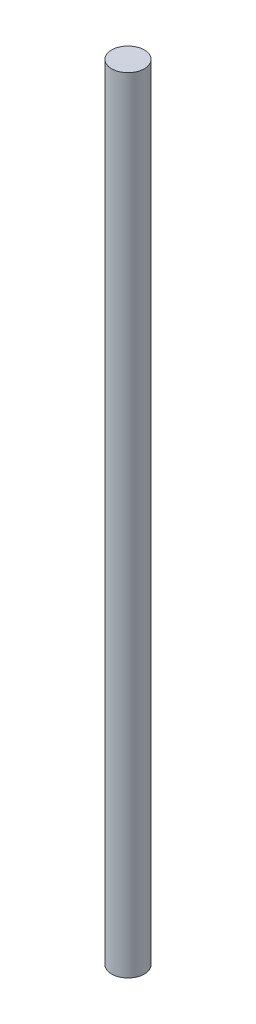
ISO-10303-21;
HEADER;
FILE_DESCRIPTION(('STEP AP214'),'2;1');
FILE_NAME('part.step','',(''),(''),'','','');
FILE_SCHEMA(('AUTOMOTIVE_DESIGN { 1 0 10303 214 1 1 1 1 }'));
ENDSEC;
DATA;
#1=APPLICATION_CONTEXT('core data for automotive mechanical design processes');
#2=APPLICATION_PROTOCOL_DEFINITION('international standard','automotive_design',2000,#1);
#3=PRODUCT_CONTEXT('',#1,'mechanical');
#4=PRODUCT('Part','Part','',(#3));
#5=PRODUCT_RELATED_PRODUCT_CATEGORY('part','',(#4));
#6=PRODUCT_DEFINITION_FORMATION('','',#4);
#7=PRODUCT_DEFINITION_CONTEXT('part definition',#1,'design');
#8=PRODUCT_DEFINITION('design','',#6,#7);
#9=PRODUCT_DEFINITION_SHAPE('','',#8);
#10=(LENGTH_UNIT() NAMED_UNIT(*) SI_UNIT(.MILLI.,.METRE.));
#11=(NAMED_UNIT(*) PLANE_ANGLE_UNIT() SI_UNIT($,.RADIAN.));
#12=(NAMED_UNIT(*) SI_UNIT($,.STERADIAN.) SOLID_ANGLE_UNIT());
#13=UNCERTAINTY_MEASURE_WITH_UNIT(LENGTH_MEASURE(1.E-05),#10,'distance_accuracy_value','');
#14=(GEOMETRIC_REPRESENTATION_CONTEXT(3) GLOBAL_UNCERTAINTY_ASSIGNED_CONTEXT((#13)) GLOBAL_UNIT_ASSIGNED_CONTEXT((#10,
#11,#12)) REPRESENTATION_CONTEXT('',''));
#15=CARTESIAN_POINT('',(0.,0.,0.));
#16=DIRECTION('',(0.,0.,1.));
#17=DIRECTION('',(1.,0.,0.));
#18=AXIS2_PLACEMENT_3D('',#15,#16,#17);
#19=CARTESIAN_POINT('',(0.,76.2,0.));
#20=DIRECTION('',(0.,-1.,0.));
#21=DIRECTION('',(0.,0.,-1.));
#22=AXIS2_PLACEMENT_3D('',#19,#20,#21);
#23=CYLINDRICAL_SURFACE('',#22,1.5875);
#24=CARTESIAN_POINT('',(0.,76.2,0.));
#25=DIRECTION('',(0.,1.,0.));
#26=DIRECTION('',(0.,0.,1.));
#27=AXIS2_PLACEMENT_3D('',#24,#25,#26);
#28=CIRCLE('',#27,1.5875);
#29=CARTESIAN_POINT('',(0.,76.2,1.5875));
#30=VERTEX_POINT('',#29);
#31=EDGE_CURVE('E10',#30,#30,#28,.T.);
#32=ORIENTED_EDGE('',*,*,#31,.F.);
#33=EDGE_LOOP('',(#32));
#34=FACE_BOUND('',#33,.T.);
#35=CARTESIAN_POINT('',(0.,0.,0.));
#36=DIRECTION('',(0.,1.,0.));
#37=DIRECTION('',(0.,0.,1.));
#38=AXIS2_PLACEMENT_3D('',#35,#36,#37);
#39=CIRCLE('',#38,1.5875);
#40=CARTESIAN_POINT('',(0.,0.,1.5875));
#41=VERTEX_POINT('',#40);
#42=EDGE_CURVE('E34',#41,#41,#39,.T.);
#43=ORIENTED_EDGE('',*,*,#42,.T.);
#44=EDGE_LOOP('',(#43));
#45=FACE_BOUND('',#44,.T.);
#46=ADVANCED_FACE('F31',(#34,#45),#23,.T.);
#47=CARTESIAN_POINT('',(0.,76.2,0.));
#48=DIRECTION('',(0.,1.,0.));
#49=DIRECTION('',(0.,0.,1.));
#50=AXIS2_PLACEMENT_3D('',#47,#48,#49);
#51=PLANE('',#50);
#52=ORIENTED_EDGE('',*,*,#31,.T.);
#53=EDGE_LOOP('',(#52));
#54=FACE_BOUND('',#53,.T.);
#55=ADVANCED_FACE('F46',(#54),#51,.T.);
#56=CARTESIAN_POINT('',(0.,0.,0.));
#57=DIRECTION('',(0.,1.,0.));
#58=DIRECTION('',(0.,0.,1.));
#59=AXIS2_PLACEMENT_3D('',#56,#57,#58);
#60=PLANE('',#59);
#61=ORIENTED_EDGE('',*,*,#42,.F.);
#62=EDGE_LOOP('',(#61));
#63=FACE_BOUND('',#62,.T.);
#64=ADVANCED_FACE('F44',(#63),#60,.F.);
#65=CLOSED_SHELL('',(#46,#55,#64));
#66=MANIFOLD_SOLID_BREP('B2',#65);
#67=ADVANCED_BREP_SHAPE_REPRESENTATION('',(#18,#66),#14);
#68=SHAPE_DEFINITION_REPRESENTATION(#9,#67);
ENDSEC;
END-ISO-10303-21;
